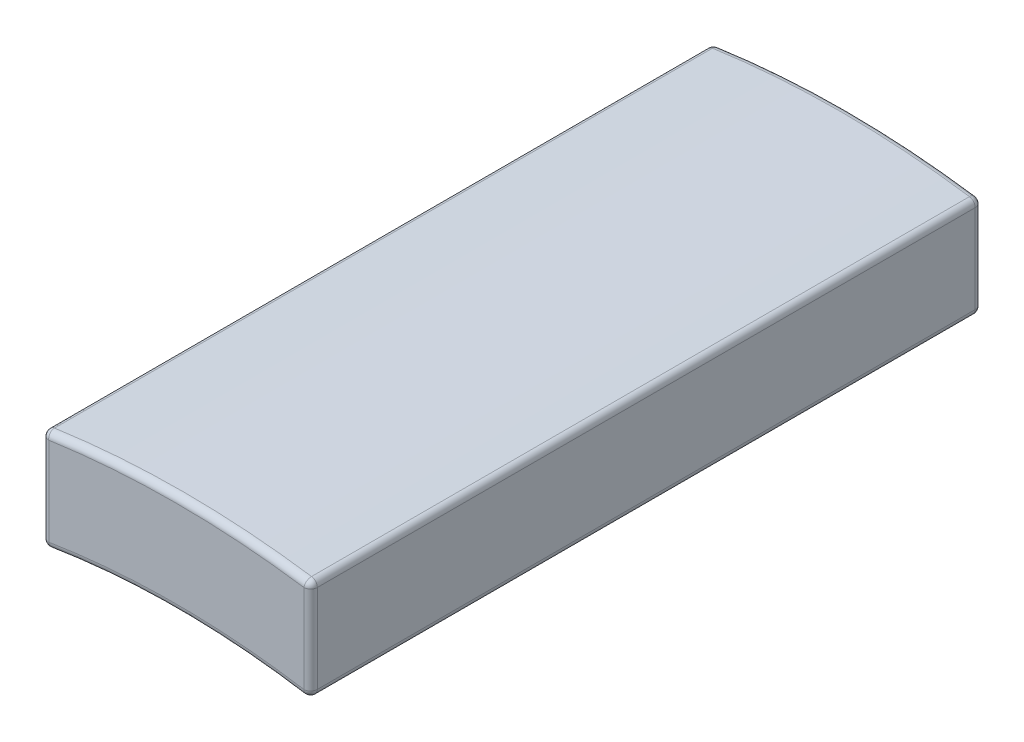
ISO-10303-21;
HEADER;
FILE_DESCRIPTION(('STEP AP214'),'2;1');
FILE_NAME('part.step','',(''),(''),'','','');
FILE_SCHEMA(('AUTOMOTIVE_DESIGN { 1 0 10303 214 1 1 1 1 }'));
ENDSEC;
DATA;
#1=APPLICATION_CONTEXT('core data for automotive mechanical design processes');
#2=APPLICATION_PROTOCOL_DEFINITION('international standard','automotive_design',2000,#1);
#3=PRODUCT_CONTEXT('',#1,'mechanical');
#4=PRODUCT('Part','Part','',(#3));
#5=PRODUCT_RELATED_PRODUCT_CATEGORY('part','',(#4));
#6=PRODUCT_DEFINITION_FORMATION('','',#4);
#7=PRODUCT_DEFINITION_CONTEXT('part definition',#1,'design');
#8=PRODUCT_DEFINITION('design','',#6,#7);
#9=PRODUCT_DEFINITION_SHAPE('','',#8);
#10=(LENGTH_UNIT() NAMED_UNIT(*) SI_UNIT(.MILLI.,.METRE.));
#11=(NAMED_UNIT(*) PLANE_ANGLE_UNIT() SI_UNIT($,.RADIAN.));
#12=(NAMED_UNIT(*) SI_UNIT($,.STERADIAN.) SOLID_ANGLE_UNIT());
#13=UNCERTAINTY_MEASURE_WITH_UNIT(LENGTH_MEASURE(1.E-05),#10,'distance_accuracy_value','');
#14=(GEOMETRIC_REPRESENTATION_CONTEXT(3) GLOBAL_UNCERTAINTY_ASSIGNED_CONTEXT((#13)) GLOBAL_UNIT_ASSIGNED_CONTEXT((#10,
#11,#12)) REPRESENTATION_CONTEXT('',''));
#15=CARTESIAN_POINT('',(0.,0.,0.));
#16=DIRECTION('',(0.,0.,1.));
#17=DIRECTION('',(1.,0.,0.));
#18=AXIS2_PLACEMENT_3D('',#15,#16,#17);
#19=CARTESIAN_POINT('',(0.,0.,0.1));
#20=DIRECTION('',(0.,0.,1.));
#21=DIRECTION('',(1.,0.,0.));
#22=AXIS2_PLACEMENT_3D('',#19,#20,#21);
#23=TOROIDAL_SURFACE('',#22,11.95,0.1);
#24=CARTESIAN_POINT('',(-1.9,11.7979871164534,0.1));
#25=DIRECTION('',(0.987279256606977,0.158995815899586,0.));
#26=DIRECTION('',(-0.158995815899586,0.987279256606977,0.));
#27=AXIS2_PLACEMENT_3D('',#24,#25,#26);
#28=CIRCLE('',#27,0.1);
#29=CARTESIAN_POINT('',(-1.88410041841004,11.6992591907927,0.1));
#30=VERTEX_POINT('',#29);
#31=CARTESIAN_POINT('',(-1.9,11.7979871164534,0.));
#32=VERTEX_POINT('',#31);
#33=EDGE_CURVE('E28',#30,#32,#28,.T.);
#34=ORIENTED_EDGE('',*,*,#33,.T.);
#35=CARTESIAN_POINT('',(0.,0.,0.));
#36=DIRECTION('',(0.,0.,1.));
#37=DIRECTION('',(1.,0.,0.));
#38=AXIS2_PLACEMENT_3D('',#35,#36,#37);
#39=CIRCLE('',#38,11.95);
#40=CARTESIAN_POINT('',(1.9,11.7979871164534,0.));
#41=VERTEX_POINT('',#40);
#42=EDGE_CURVE('E167',#41,#32,#39,.T.);
#43=ORIENTED_EDGE('',*,*,#42,.F.);
#44=CARTESIAN_POINT('',(1.9,11.7979871164534,0.1));
#45=DIRECTION('',(-0.987279256606978,0.158995815899582,0.));
#46=DIRECTION('',(-0.158995815899582,-0.987279256606978,0.));
#47=AXIS2_PLACEMENT_3D('',#44,#45,#46);
#48=CIRCLE('',#47,0.1);
#49=CARTESIAN_POINT('',(1.88410041841004,11.6992591907927,0.1));
#50=VERTEX_POINT('',#49);
#51=EDGE_CURVE('E11',#41,#50,#48,.T.);
#52=ORIENTED_EDGE('',*,*,#51,.T.);
#53=CARTESIAN_POINT('',(0.,0.,0.1));
#54=DIRECTION('',(0.,0.,-1.));
#55=DIRECTION('',(1.,0.,0.));
#56=AXIS2_PLACEMENT_3D('',#53,#54,#55);
#57=CIRCLE('',#56,11.85);
#58=EDGE_CURVE('E274',#30,#50,#57,.T.);
#59=ORIENTED_EDGE('',*,*,#58,.F.);
#60=EDGE_LOOP('',(#34,#43,#52,#59));
#61=FACE_BOUND('',#60,.T.);
#62=ADVANCED_FACE('F17',(#61),#23,.T.);
#63=CARTESIAN_POINT('',(1.9,11.7979871164534,0.1));
#64=DIRECTION('',(0.,1.,0.));
#65=DIRECTION('',(1.,0.,0.));
#66=AXIS2_PLACEMENT_3D('',#63,#64,#65);
#67=SPHERICAL_SURFACE('',#66,0.1);
#68=CARTESIAN_POINT('',(1.9,11.7979871164534,0.1));
#69=DIRECTION('',(0.,-1.,0.));
#70=DIRECTION('',(0.,0.,-1.));
#71=AXIS2_PLACEMENT_3D('',#68,#69,#70);
#72=CIRCLE('',#71,0.1);
#73=CARTESIAN_POINT('',(2.,11.7979871164534,0.1));
#74=VERTEX_POINT('',#73);
#75=EDGE_CURVE('E21',#41,#74,#72,.T.);
#76=ORIENTED_EDGE('',*,*,#75,.T.);
#77=CARTESIAN_POINT('',(1.9,11.7979871164534,0.1));
#78=DIRECTION('',(0.,0.,1.));
#79=DIRECTION('',(-1.,0.,0.));
#80=AXIS2_PLACEMENT_3D('',#77,#78,#79);
#81=CIRCLE('',#80,0.1);
#82=EDGE_CURVE('E151',#50,#74,#81,.T.);
#83=ORIENTED_EDGE('',*,*,#82,.F.);
#84=ORIENTED_EDGE('',*,*,#51,.F.);
#85=EDGE_LOOP('',(#76,#83,#84));
#86=FACE_BOUND('',#85,.T.);
#87=ADVANCED_FACE('F148',(#86),#67,.T.);
#88=CARTESIAN_POINT('',(-1.9,11.7979871164534,0.1));
#89=DIRECTION('',(0.,1.,0.));
#90=DIRECTION('',(1.,0.,0.));
#91=AXIS2_PLACEMENT_3D('',#88,#89,#90);
#92=SPHERICAL_SURFACE('',#91,0.1);
#93=CARTESIAN_POINT('',(-1.9,11.7979871164534,0.1));
#94=DIRECTION('',(0.,0.,1.));
#95=DIRECTION('',(-1.,0.,0.));
#96=AXIS2_PLACEMENT_3D('',#93,#94,#95);
#97=CIRCLE('',#96,0.1);
#98=CARTESIAN_POINT('',(-2.,11.7979871164534,0.1));
#99=VERTEX_POINT('',#98);
#100=EDGE_CURVE('E190',#99,#30,#97,.T.);
#101=ORIENTED_EDGE('',*,*,#100,.F.);
#102=CARTESIAN_POINT('',(-1.9,11.7979871164534,0.1));
#103=DIRECTION('',(0.,-1.,0.));
#104=DIRECTION('',(0.,0.,-1.));
#105=AXIS2_PLACEMENT_3D('',#102,#103,#104);
#106=CIRCLE('',#105,0.1);
#107=EDGE_CURVE('E165',#99,#32,#106,.T.);
#108=ORIENTED_EDGE('',*,*,#107,.T.);
#109=ORIENTED_EDGE('',*,*,#33,.F.);
#110=EDGE_LOOP('',(#101,#108,#109));
#111=FACE_BOUND('',#110,.T.);
#112=ADVANCED_FACE('F584',(#111),#92,.T.);
#113=CARTESIAN_POINT('',(1.9,11.7979871164534,0.1));
#114=DIRECTION('',(0.,1.,0.));
#115=DIRECTION('',(0.,0.,1.));
#116=AXIS2_PLACEMENT_3D('',#113,#114,#115);
#117=CYLINDRICAL_SURFACE('',#116,0.1);
#118=CARTESIAN_POINT('',(1.9,13.1130660030368,0.1));
#119=DIRECTION('',(0.,-1.,0.));
#120=DIRECTION('',(0.,0.,-1.));
#121=AXIS2_PLACEMENT_3D('',#118,#119,#120);
#122=CIRCLE('',#121,0.1);
#123=CARTESIAN_POINT('',(1.9,13.1130660030368,0.));
#124=VERTEX_POINT('',#123);
#125=CARTESIAN_POINT('',(2.,13.1130660030368,0.1));
#126=VERTEX_POINT('',#125);
#127=EDGE_CURVE('E210',#124,#126,#122,.T.);
#128=ORIENTED_EDGE('',*,*,#127,.T.);
#129=DIRECTION('',(0.,1.,0.));
#130=VECTOR('',#129,1.);
#131=CARTESIAN_POINT('',(2.,11.7979871164534,0.1));
#132=LINE('',#131,#130);
#133=EDGE_CURVE('E162',#74,#126,#132,.T.);
#134=ORIENTED_EDGE('',*,*,#133,.F.);
#135=ORIENTED_EDGE('',*,*,#75,.F.);
#136=DIRECTION('',(0.,-1.,0.));
#137=VECTOR('',#136,1.);
#138=CARTESIAN_POINT('',(1.9,11.7979871164534,0.));
#139=LINE('',#138,#137);
#140=EDGE_CURVE('E160',#124,#41,#139,.T.);
#141=ORIENTED_EDGE('',*,*,#140,.F.);
#142=EDGE_LOOP('',(#128,#134,#135,#141));
#143=FACE_BOUND('',#142,.T.);
#144=ADVANCED_FACE('F158',(#143),#117,.T.);
#145=CARTESIAN_POINT('',(-1.9,11.7979871164534,0.1));
#146=DIRECTION('',(0.,-1.,0.));
#147=DIRECTION('',(0.,0.,-1.));
#148=AXIS2_PLACEMENT_3D('',#145,#146,#147);
#149=CYLINDRICAL_SURFACE('',#148,0.1);
#150=CARTESIAN_POINT('',(-1.9,13.1130660030368,0.1));
#151=DIRECTION('',(0.,-1.,0.));
#152=DIRECTION('',(0.,0.,-1.));
#153=AXIS2_PLACEMENT_3D('',#150,#151,#152);
#154=CIRCLE('',#153,0.1);
#155=CARTESIAN_POINT('',(-2.,13.1130660030368,0.1));
#156=VERTEX_POINT('',#155);
#157=CARTESIAN_POINT('',(-1.9,13.1130660030368,0.));
#158=VERTEX_POINT('',#157);
#159=EDGE_CURVE('E43',#156,#158,#154,.T.);
#160=ORIENTED_EDGE('',*,*,#159,.T.);
#161=DIRECTION('',(0.,1.,0.));
#162=VECTOR('',#161,1.);
#163=CARTESIAN_POINT('',(-1.9,11.7979871164534,0.));
#164=LINE('',#163,#162);
#165=EDGE_CURVE('E172',#32,#158,#164,.T.);
#166=ORIENTED_EDGE('',*,*,#165,.F.);
#167=ORIENTED_EDGE('',*,*,#107,.F.);
#168=DIRECTION('',(0.,-1.,0.));
#169=VECTOR('',#168,1.);
#170=CARTESIAN_POINT('',(-2.,11.7979871164534,0.1));
#171=LINE('',#170,#169);
#172=EDGE_CURVE('E253',#156,#99,#171,.T.);
#173=ORIENTED_EDGE('',*,*,#172,.F.);
#174=EDGE_LOOP('',(#160,#166,#167,#173));
#175=FACE_BOUND('',#174,.T.);
#176=ADVANCED_FACE('F298',(#175),#149,.T.);
#177=CARTESIAN_POINT('',(1.9,13.1130660030368,0.1));
#178=DIRECTION('',(0.,1.,0.));
#179=DIRECTION('',(1.,0.,0.));
#180=AXIS2_PLACEMENT_3D('',#177,#178,#179);
#181=SPHERICAL_SURFACE('',#180,0.1);
#182=CARTESIAN_POINT('',(1.9,13.1130660030368,0.1));
#183=DIRECTION('',(0.98966535871976,-0.14339622641509,0.));
#184=DIRECTION('',(0.14339622641509,0.98966535871976,0.));
#185=AXIS2_PLACEMENT_3D('',#182,#183,#184);
#186=CIRCLE('',#185,0.1);
#187=CARTESIAN_POINT('',(1.91433962264151,13.2120325389088,0.1));
#188=VERTEX_POINT('',#187);
#189=EDGE_CURVE('E128',#124,#188,#186,.T.);
#190=ORIENTED_EDGE('',*,*,#189,.T.);
#191=CARTESIAN_POINT('',(1.9,13.1130660030368,0.1));
#192=DIRECTION('',(0.,0.,1.));
#193=DIRECTION('',(-1.,0.,0.));
#194=AXIS2_PLACEMENT_3D('',#191,#192,#193);
#195=CIRCLE('',#194,0.1);
#196=EDGE_CURVE('E309',#126,#188,#195,.T.);
#197=ORIENTED_EDGE('',*,*,#196,.F.);
#198=ORIENTED_EDGE('',*,*,#127,.F.);
#199=EDGE_LOOP('',(#190,#197,#198));
#200=FACE_BOUND('',#199,.T.);
#201=ADVANCED_FACE('F690',(#200),#181,.T.);
#202=CARTESIAN_POINT('',(-1.9,13.1130660030368,0.1));
#203=DIRECTION('',(0.,1.,0.));
#204=DIRECTION('',(1.,0.,0.));
#205=AXIS2_PLACEMENT_3D('',#202,#203,#204);
#206=SPHERICAL_SURFACE('',#205,0.1);
#207=CARTESIAN_POINT('',(-1.9,13.1130660030368,0.1));
#208=DIRECTION('',(0.,0.,1.));
#209=DIRECTION('',(-1.,0.,0.));
#210=AXIS2_PLACEMENT_3D('',#207,#208,#209);
#211=CIRCLE('',#210,0.1);
#212=CARTESIAN_POINT('',(-1.91433962264151,13.2120325389088,0.1));
#213=VERTEX_POINT('',#212);
#214=EDGE_CURVE('E242',#213,#156,#211,.T.);
#215=ORIENTED_EDGE('',*,*,#214,.F.);
#216=CARTESIAN_POINT('',(-1.9,13.1130660030368,0.1));
#217=DIRECTION('',(-0.98966535871976,-0.143396226415095,0.));
#218=DIRECTION('',(0.143396226415095,-0.98966535871976,0.));
#219=AXIS2_PLACEMENT_3D('',#216,#217,#218);
#220=CIRCLE('',#219,0.1);
#221=EDGE_CURVE('E204',#213,#158,#220,.T.);
#222=ORIENTED_EDGE('',*,*,#221,.T.);
#223=ORIENTED_EDGE('',*,*,#159,.F.);
#224=EDGE_LOOP('',(#215,#222,#223));
#225=FACE_BOUND('',#224,.T.);
#226=ADVANCED_FACE('F295',(#225),#206,.T.);
#227=CARTESIAN_POINT('',(0.,0.,0.1));
#228=DIRECTION('',(0.,0.,1.));
#229=DIRECTION('',(1.,0.,0.));
#230=AXIS2_PLACEMENT_3D('',#227,#228,#229);
#231=TOROIDAL_SURFACE('',#230,13.25,0.1);
#232=ORIENTED_EDGE('',*,*,#221,.F.);
#233=CARTESIAN_POINT('',(0.,0.,0.1));
#234=DIRECTION('',(0.,0.,1.));
#235=DIRECTION('',(1.,0.,0.));
#236=AXIS2_PLACEMENT_3D('',#233,#234,#235);
#237=CIRCLE('',#236,13.35);
#238=EDGE_CURVE('E211',#188,#213,#237,.T.);
#239=ORIENTED_EDGE('',*,*,#238,.F.);
#240=ORIENTED_EDGE('',*,*,#189,.F.);
#241=CARTESIAN_POINT('',(0.,0.,0.));
#242=DIRECTION('',(0.,0.,-1.));
#243=DIRECTION('',(1.,0.,0.));
#244=AXIS2_PLACEMENT_3D('',#241,#242,#243);
#245=CIRCLE('',#244,13.25);
#246=EDGE_CURVE('E177',#158,#124,#245,.T.);
#247=ORIENTED_EDGE('',*,*,#246,.F.);
#248=EDGE_LOOP('',(#232,#239,#240,#247));
#249=FACE_BOUND('',#248,.T.);
#250=ADVANCED_FACE('F293',(#249),#231,.T.);
#251=CARTESIAN_POINT('',(-1.9,11.7979871164534,9.9));
#252=DIRECTION('',(0.,1.,0.));
#253=DIRECTION('',(0.,0.,1.));
#254=AXIS2_PLACEMENT_3D('',#251,#252,#253);
#255=CYLINDRICAL_SURFACE('',#254,0.1);
#256=CARTESIAN_POINT('',(-1.9,13.1130660030368,9.9));
#257=DIRECTION('',(0.,-1.,0.));
#258=DIRECTION('',(0.,0.,-1.));
#259=AXIS2_PLACEMENT_3D('',#256,#257,#258);
#260=CIRCLE('',#259,0.1);
#261=CARTESIAN_POINT('',(-1.9,13.1130660030368,10.));
#262=VERTEX_POINT('',#261);
#263=CARTESIAN_POINT('',(-2.,13.1130660030368,9.9));
#264=VERTEX_POINT('',#263);
#265=EDGE_CURVE('E225',#262,#264,#260,.T.);
#266=ORIENTED_EDGE('',*,*,#265,.T.);
#267=DIRECTION('',(0.,1.,0.));
#268=VECTOR('',#267,1.);
#269=CARTESIAN_POINT('',(-2.,13.1130660030368,9.9));
#270=LINE('',#269,#268);
#271=CARTESIAN_POINT('',(-2.,11.7979871164534,9.9));
#272=VERTEX_POINT('',#271);
#273=EDGE_CURVE('E279',#272,#264,#270,.T.);
#274=ORIENTED_EDGE('',*,*,#273,.F.);
#275=CARTESIAN_POINT('',(-1.9,11.7979871164534,9.9));
#276=DIRECTION('',(0.,1.,0.));
#277=DIRECTION('',(0.,0.,1.));
#278=AXIS2_PLACEMENT_3D('',#275,#276,#277);
#279=CIRCLE('',#278,0.1);
#280=CARTESIAN_POINT('',(-1.9,11.7979871164534,10.));
#281=VERTEX_POINT('',#280);
#282=EDGE_CURVE('E207',#272,#281,#279,.T.);
#283=ORIENTED_EDGE('',*,*,#282,.T.);
#284=DIRECTION('',(0.,-1.,0.));
#285=VECTOR('',#284,1.);
#286=CARTESIAN_POINT('',(-1.9,11.7979871164534,10.));
#287=LINE('',#286,#285);
#288=EDGE_CURVE('E195',#262,#281,#287,.T.);
#289=ORIENTED_EDGE('',*,*,#288,.F.);
#290=EDGE_LOOP('',(#266,#274,#283,#289));
#291=FACE_BOUND('',#290,.T.);
#292=ADVANCED_FACE('F642',(#291),#255,.T.);
#293=CARTESIAN_POINT('',(-1.9,11.7979871164534,9.9));
#294=DIRECTION('',(0.,1.,0.));
#295=DIRECTION('',(1.,0.,0.));
#296=AXIS2_PLACEMENT_3D('',#293,#294,#295);
#297=SPHERICAL_SURFACE('',#296,0.1);
#298=CARTESIAN_POINT('',(-1.9,11.7979871164534,9.9));
#299=DIRECTION('',(0.,0.,-1.));
#300=DIRECTION('',(-1.,0.,0.));
#301=AXIS2_PLACEMENT_3D('',#298,#299,#300);
#302=CIRCLE('',#301,0.1);
#303=CARTESIAN_POINT('',(-1.88410041841004,11.6992591907927,9.9));
#304=VERTEX_POINT('',#303);
#305=EDGE_CURVE('E235',#304,#272,#302,.T.);
#306=ORIENTED_EDGE('',*,*,#305,.F.);
#307=CARTESIAN_POINT('',(-1.9,11.7979871164534,9.9));
#308=DIRECTION('',(-0.987279256606977,-0.158995815899584,0.));
#309=DIRECTION('',(0.158995815899584,-0.987279256606977,0.));
#310=AXIS2_PLACEMENT_3D('',#307,#308,#309);
#311=CIRCLE('',#310,0.1);
#312=EDGE_CURVE('E221',#304,#281,#311,.T.);
#313=ORIENTED_EDGE('',*,*,#312,.T.);
#314=ORIENTED_EDGE('',*,*,#282,.F.);
#315=EDGE_LOOP('',(#306,#313,#314));
#316=FACE_BOUND('',#315,.T.);
#317=ADVANCED_FACE('F638',(#316),#297,.T.);
#318=CARTESIAN_POINT('',(-1.9,13.1130660030368,9.9));
#319=DIRECTION('',(0.,1.,0.));
#320=DIRECTION('',(1.,0.,0.));
#321=AXIS2_PLACEMENT_3D('',#318,#319,#320);
#322=SPHERICAL_SURFACE('',#321,0.1);
#323=CARTESIAN_POINT('',(-1.9,13.1130660030368,9.9));
#324=DIRECTION('',(-0.989665358719761,-0.143396226415086,0.));
#325=DIRECTION('',(0.143396226415086,-0.989665358719761,0.));
#326=AXIS2_PLACEMENT_3D('',#323,#324,#325);
#327=CIRCLE('',#326,0.1);
#328=CARTESIAN_POINT('',(-1.91433962264151,13.2120325389088,9.9));
#329=VERTEX_POINT('',#328);
#330=EDGE_CURVE('E226',#262,#329,#327,.T.);
#331=ORIENTED_EDGE('',*,*,#330,.T.);
#332=CARTESIAN_POINT('',(-1.9,13.1130660030368,9.9));
#333=DIRECTION('',(0.,0.,-1.));
#334=DIRECTION('',(-1.,0.,0.));
#335=AXIS2_PLACEMENT_3D('',#332,#333,#334);
#336=CIRCLE('',#335,0.1);
#337=EDGE_CURVE('E241',#264,#329,#336,.T.);
#338=ORIENTED_EDGE('',*,*,#337,.F.);
#339=ORIENTED_EDGE('',*,*,#265,.F.);
#340=EDGE_LOOP('',(#331,#338,#339));
#341=FACE_BOUND('',#340,.T.);
#342=ADVANCED_FACE('F593',(#341),#322,.T.);
#343=CARTESIAN_POINT('',(0.,0.,9.9));
#344=DIRECTION('',(0.,0.,1.));
#345=DIRECTION('',(1.,0.,0.));
#346=AXIS2_PLACEMENT_3D('',#343,#344,#345);
#347=TOROIDAL_SURFACE('',#346,11.95,0.1);
#348=CARTESIAN_POINT('',(1.9,11.7979871164534,9.9));
#349=DIRECTION('',(-0.987279256606978,0.158995815899582,0.));
#350=DIRECTION('',(-0.158995815899582,-0.987279256606978,0.));
#351=AXIS2_PLACEMENT_3D('',#348,#349,#350);
#352=CIRCLE('',#351,0.1);
#353=CARTESIAN_POINT('',(1.88410041841004,11.6992591907927,9.9));
#354=VERTEX_POINT('',#353);
#355=CARTESIAN_POINT('',(1.9,11.7979871164534,10.));
#356=VERTEX_POINT('',#355);
#357=EDGE_CURVE('E202',#354,#356,#352,.T.);
#358=ORIENTED_EDGE('',*,*,#357,.T.);
#359=CARTESIAN_POINT('',(0.,0.,10.));
#360=DIRECTION('',(0.,0.,-1.));
#361=DIRECTION('',(1.,0.,0.));
#362=AXIS2_PLACEMENT_3D('',#359,#360,#361);
#363=CIRCLE('',#362,11.95);
#364=EDGE_CURVE('E186',#281,#356,#363,.T.);
#365=ORIENTED_EDGE('',*,*,#364,.F.);
#366=ORIENTED_EDGE('',*,*,#312,.F.);
#367=CARTESIAN_POINT('',(0.,0.,9.9));
#368=DIRECTION('',(0.,0.,1.));
#369=DIRECTION('',(1.,0.,0.));
#370=AXIS2_PLACEMENT_3D('',#367,#368,#369);
#371=CIRCLE('',#370,11.85);
#372=EDGE_CURVE('E314',#354,#304,#371,.T.);
#373=ORIENTED_EDGE('',*,*,#372,.F.);
#374=EDGE_LOOP('',(#358,#365,#366,#373));
#375=FACE_BOUND('',#374,.T.);
#376=ADVANCED_FACE('F589',(#375),#347,.T.);
#377=CARTESIAN_POINT('',(0.,0.,9.9));
#378=DIRECTION('',(0.,0.,1.));
#379=DIRECTION('',(1.,0.,0.));
#380=AXIS2_PLACEMENT_3D('',#377,#378,#379);
#381=TOROIDAL_SURFACE('',#380,13.25,0.1);
#382=CARTESIAN_POINT('',(1.9,13.1130660030368,9.9));
#383=DIRECTION('',(-0.98966535871976,0.14339622641509,0.));
#384=DIRECTION('',(-0.14339622641509,-0.98966535871976,0.));
#385=AXIS2_PLACEMENT_3D('',#382,#383,#384);
#386=CIRCLE('',#385,0.1);
#387=CARTESIAN_POINT('',(1.9,13.1130660030368,10.));
#388=VERTEX_POINT('',#387);
#389=CARTESIAN_POINT('',(1.91433962264151,13.2120325389088,9.9));
#390=VERTEX_POINT('',#389);
#391=EDGE_CURVE('E112',#388,#390,#386,.T.);
#392=ORIENTED_EDGE('',*,*,#391,.T.);
#393=CARTESIAN_POINT('',(0.,0.,9.9));
#394=DIRECTION('',(0.,0.,-1.));
#395=DIRECTION('',(1.,0.,0.));
#396=AXIS2_PLACEMENT_3D('',#393,#394,#395);
#397=CIRCLE('',#396,13.35);
#398=EDGE_CURVE('E255',#329,#390,#397,.T.);
#399=ORIENTED_EDGE('',*,*,#398,.F.);
#400=ORIENTED_EDGE('',*,*,#330,.F.);
#401=CARTESIAN_POINT('',(0.,0.,10.));
#402=DIRECTION('',(0.,0.,1.));
#403=DIRECTION('',(1.,0.,0.));
#404=AXIS2_PLACEMENT_3D('',#401,#402,#403);
#405=CIRCLE('',#404,13.25);
#406=EDGE_CURVE('E199',#388,#262,#405,.T.);
#407=ORIENTED_EDGE('',*,*,#406,.F.);
#408=EDGE_LOOP('',(#392,#399,#400,#407));
#409=FACE_BOUND('',#408,.T.);
#410=ADVANCED_FACE('F19',(#409),#381,.T.);
#411=CARTESIAN_POINT('',(1.9,11.7979871164534,9.9));
#412=DIRECTION('',(0.,1.,0.));
#413=DIRECTION('',(1.,0.,0.));
#414=AXIS2_PLACEMENT_3D('',#411,#412,#413);
#415=SPHERICAL_SURFACE('',#414,0.1);
#416=CARTESIAN_POINT('',(1.9,11.7979871164534,9.9));
#417=DIRECTION('',(0.,0.,-1.));
#418=DIRECTION('',(-1.,0.,0.));
#419=AXIS2_PLACEMENT_3D('',#416,#417,#418);
#420=CIRCLE('',#419,0.1);
#421=CARTESIAN_POINT('',(2.,11.7979871164534,9.9));
#422=VERTEX_POINT('',#421);
#423=EDGE_CURVE('E220',#422,#354,#420,.T.);
#424=ORIENTED_EDGE('',*,*,#423,.F.);
#425=CARTESIAN_POINT('',(1.9,11.7979871164534,9.9));
#426=DIRECTION('',(0.,-1.,0.));
#427=DIRECTION('',(0.,0.,-1.));
#428=AXIS2_PLACEMENT_3D('',#425,#426,#427);
#429=CIRCLE('',#428,0.1);
#430=EDGE_CURVE('E194',#422,#356,#429,.T.);
#431=ORIENTED_EDGE('',*,*,#430,.T.);
#432=ORIENTED_EDGE('',*,*,#357,.F.);
#433=EDGE_LOOP('',(#424,#431,#432));
#434=FACE_BOUND('',#433,.T.);
#435=ADVANCED_FACE('F714',(#434),#415,.T.);
#436=CARTESIAN_POINT('',(1.9,13.1130660030368,9.9));
#437=DIRECTION('',(0.,1.,0.));
#438=DIRECTION('',(1.,0.,0.));
#439=AXIS2_PLACEMENT_3D('',#436,#437,#438);
#440=SPHERICAL_SURFACE('',#439,0.1);
#441=CARTESIAN_POINT('',(1.9,13.1130660030368,9.9));
#442=DIRECTION('',(0.,1.,0.));
#443=DIRECTION('',(0.,0.,1.));
#444=AXIS2_PLACEMENT_3D('',#441,#442,#443);
#445=CIRCLE('',#444,0.1);
#446=CARTESIAN_POINT('',(2.,13.1130660030368,9.9));
#447=VERTEX_POINT('',#446);
#448=EDGE_CURVE('E203',#388,#447,#445,.T.);
#449=ORIENTED_EDGE('',*,*,#448,.T.);
#450=CARTESIAN_POINT('',(1.9,13.1130660030368,9.9));
#451=DIRECTION('',(0.,0.,-1.));
#452=DIRECTION('',(-1.,0.,0.));
#453=AXIS2_PLACEMENT_3D('',#450,#451,#452);
#454=CIRCLE('',#453,0.1);
#455=EDGE_CURVE('E216',#390,#447,#454,.T.);
#456=ORIENTED_EDGE('',*,*,#455,.F.);
#457=ORIENTED_EDGE('',*,*,#391,.F.);
#458=EDGE_LOOP('',(#449,#456,#457));
#459=FACE_BOUND('',#458,.T.);
#460=ADVANCED_FACE('F710',(#459),#440,.T.);
#461=CARTESIAN_POINT('',(1.9,11.7979871164534,9.9));
#462=DIRECTION('',(0.,-1.,0.));
#463=DIRECTION('',(0.,0.,-1.));
#464=AXIS2_PLACEMENT_3D('',#461,#462,#463);
#465=CYLINDRICAL_SURFACE('',#464,0.1);
#466=ORIENTED_EDGE('',*,*,#430,.F.);
#467=DIRECTION('',(0.,-1.,0.));
#468=VECTOR('',#467,1.);
#469=CARTESIAN_POINT('',(2.,11.7979871164534,9.9));
#470=LINE('',#469,#468);
#471=EDGE_CURVE('E270',#447,#422,#470,.T.);
#472=ORIENTED_EDGE('',*,*,#471,.F.);
#473=ORIENTED_EDGE('',*,*,#448,.F.);
#474=DIRECTION('',(0.,1.,0.));
#475=VECTOR('',#474,1.);
#476=CARTESIAN_POINT('',(1.9,13.1130660030368,10.));
#477=LINE('',#476,#475);
#478=EDGE_CURVE('E179',#356,#388,#477,.T.);
#479=ORIENTED_EDGE('',*,*,#478,.F.);
#480=EDGE_LOOP('',(#466,#472,#473,#479));
#481=FACE_BOUND('',#480,.T.);
#482=ADVANCED_FACE('F682',(#481),#465,.T.);
#483=CARTESIAN_POINT('',(-1.9,11.7979871164534,0.));
#484=DIRECTION('',(0.,0.,1.));
#485=DIRECTION('',(1.,0.,0.));
#486=AXIS2_PLACEMENT_3D('',#483,#484,#485);
#487=PLANE('',#486);
#488=ORIENTED_EDGE('',*,*,#140,.T.);
#489=ORIENTED_EDGE('',*,*,#42,.T.);
#490=ORIENTED_EDGE('',*,*,#165,.T.);
#491=ORIENTED_EDGE('',*,*,#246,.T.);
#492=EDGE_LOOP('',(#488,#489,#490,#491));
#493=FACE_BOUND('',#492,.T.);
#494=ADVANCED_FACE('F175',(#493),#487,.F.);
#495=CARTESIAN_POINT('',(-1.9,11.7979871164534,10.));
#496=DIRECTION('',(0.,0.,1.));
#497=DIRECTION('',(1.,0.,0.));
#498=AXIS2_PLACEMENT_3D('',#495,#496,#497);
#499=PLANE('',#498);
#500=ORIENTED_EDGE('',*,*,#406,.T.);
#501=ORIENTED_EDGE('',*,*,#288,.T.);
#502=ORIENTED_EDGE('',*,*,#364,.T.);
#503=ORIENTED_EDGE('',*,*,#478,.T.);
#504=EDGE_LOOP('',(#500,#501,#502,#503));
#505=FACE_BOUND('',#504,.T.);
#506=ADVANCED_FACE('F666',(#505),#499,.T.);
#507=CARTESIAN_POINT('',(-2.,11.7979871164534,10.));
#508=DIRECTION('',(1.,0.,0.));
#509=DIRECTION('',(0.,1.,0.));
#510=AXIS2_PLACEMENT_3D('',#507,#508,#509);
#511=PLANE('',#510);
#512=DIRECTION('',(0.,0.,-1.));
#513=VECTOR('',#512,1.);
#514=CARTESIAN_POINT('',(-2.,13.1130660030368,10.));
#515=LINE('',#514,#513);
#516=EDGE_CURVE('E238',#264,#156,#515,.T.);
#517=ORIENTED_EDGE('',*,*,#516,.T.);
#518=ORIENTED_EDGE('',*,*,#172,.T.);
#519=DIRECTION('',(0.,0.,-1.));
#520=VECTOR('',#519,1.);
#521=CARTESIAN_POINT('',(-2.,11.7979871164534,10.));
#522=LINE('',#521,#520);
#523=EDGE_CURVE('E320',#272,#99,#522,.T.);
#524=ORIENTED_EDGE('',*,*,#523,.F.);
#525=ORIENTED_EDGE('',*,*,#273,.T.);
#526=EDGE_LOOP('',(#517,#518,#524,#525));
#527=FACE_BOUND('',#526,.T.);
#528=ADVANCED_FACE('F633',(#527),#511,.F.);
#529=CARTESIAN_POINT('',(-1.9,13.1130660030368,10.));
#530=DIRECTION('',(0.,0.,-1.));
#531=DIRECTION('',(-1.,0.,0.));
#532=AXIS2_PLACEMENT_3D('',#529,#530,#531);
#533=CYLINDRICAL_SURFACE('',#532,0.1);
#534=DIRECTION('',(0.,0.,-1.));
#535=VECTOR('',#534,1.);
#536=CARTESIAN_POINT('',(-1.91433962264151,13.2120325389088,10.));
#537=LINE('',#536,#535);
#538=EDGE_CURVE('E215',#329,#213,#537,.T.);
#539=ORIENTED_EDGE('',*,*,#538,.T.);
#540=ORIENTED_EDGE('',*,*,#214,.T.);
#541=ORIENTED_EDGE('',*,*,#516,.F.);
#542=ORIENTED_EDGE('',*,*,#337,.T.);
#543=EDGE_LOOP('',(#539,#540,#541,#542));
#544=FACE_BOUND('',#543,.T.);
#545=ADVANCED_FACE('F284',(#544),#533,.T.);
#546=CARTESIAN_POINT('',(0.,0.,10.));
#547=DIRECTION('',(0.,0.,-1.));
#548=DIRECTION('',(-1.,0.,0.));
#549=AXIS2_PLACEMENT_3D('',#546,#547,#548);
#550=CYLINDRICAL_SURFACE('',#549,13.35);
#551=DIRECTION('',(0.,0.,-1.));
#552=VECTOR('',#551,1.);
#553=CARTESIAN_POINT('',(1.91433962264151,13.2120325389088,10.));
#554=LINE('',#553,#552);
#555=EDGE_CURVE('E290',#390,#188,#554,.T.);
#556=ORIENTED_EDGE('',*,*,#555,.T.);
#557=ORIENTED_EDGE('',*,*,#238,.T.);
#558=ORIENTED_EDGE('',*,*,#538,.F.);
#559=ORIENTED_EDGE('',*,*,#398,.T.);
#560=EDGE_LOOP('',(#556,#557,#558,#559));
#561=FACE_BOUND('',#560,.T.);
#562=ADVANCED_FACE('F288',(#561),#550,.T.);
#563=CARTESIAN_POINT('',(1.9,13.1130660030368,10.));
#564=DIRECTION('',(0.,0.,-1.));
#565=DIRECTION('',(-1.,0.,0.));
#566=AXIS2_PLACEMENT_3D('',#563,#564,#565);
#567=CYLINDRICAL_SURFACE('',#566,0.1);
#568=DIRECTION('',(0.,0.,-1.));
#569=VECTOR('',#568,1.);
#570=CARTESIAN_POINT('',(2.,13.1130660030368,10.));
#571=LINE('',#570,#569);
#572=EDGE_CURVE('E219',#447,#126,#571,.T.);
#573=ORIENTED_EDGE('',*,*,#572,.T.);
#574=ORIENTED_EDGE('',*,*,#196,.T.);
#575=ORIENTED_EDGE('',*,*,#555,.F.);
#576=ORIENTED_EDGE('',*,*,#455,.T.);
#577=EDGE_LOOP('',(#573,#574,#575,#576));
#578=FACE_BOUND('',#577,.T.);
#579=ADVANCED_FACE('F616',(#578),#567,.T.);
#580=CARTESIAN_POINT('',(2.,11.7979871164534,10.));
#581=DIRECTION('',(-1.,0.,0.));
#582=DIRECTION('',(0.,0.,1.));
#583=AXIS2_PLACEMENT_3D('',#580,#581,#582);
#584=PLANE('',#583);
#585=DIRECTION('',(0.,0.,-1.));
#586=VECTOR('',#585,1.);
#587=CARTESIAN_POINT('',(2.,11.7979871164534,10.));
#588=LINE('',#587,#586);
#589=EDGE_CURVE('E236',#422,#74,#588,.T.);
#590=ORIENTED_EDGE('',*,*,#589,.T.);
#591=ORIENTED_EDGE('',*,*,#133,.T.);
#592=ORIENTED_EDGE('',*,*,#572,.F.);
#593=ORIENTED_EDGE('',*,*,#471,.T.);
#594=EDGE_LOOP('',(#590,#591,#592,#593));
#595=FACE_BOUND('',#594,.T.);
#596=ADVANCED_FACE('F624',(#595),#584,.F.);
#597=CARTESIAN_POINT('',(1.9,11.7979871164534,10.));
#598=DIRECTION('',(0.,0.,-1.));
#599=DIRECTION('',(-1.,0.,0.));
#600=AXIS2_PLACEMENT_3D('',#597,#598,#599);
#601=CYLINDRICAL_SURFACE('',#600,0.1);
#602=DIRECTION('',(0.,0.,-1.));
#603=VECTOR('',#602,1.);
#604=CARTESIAN_POINT('',(1.88410041841004,11.6992591907927,10.));
#605=LINE('',#604,#603);
#606=EDGE_CURVE('E311',#354,#50,#605,.T.);
#607=ORIENTED_EDGE('',*,*,#606,.T.);
#608=ORIENTED_EDGE('',*,*,#82,.T.);
#609=ORIENTED_EDGE('',*,*,#589,.F.);
#610=ORIENTED_EDGE('',*,*,#423,.T.);
#611=EDGE_LOOP('',(#607,#608,#609,#610));
#612=FACE_BOUND('',#611,.T.);
#613=ADVANCED_FACE('F576',(#612),#601,.T.);
#614=CARTESIAN_POINT('',(0.,0.,10.));
#615=DIRECTION('',(0.,0.,-1.));
#616=DIRECTION('',(-1.,0.,0.));
#617=AXIS2_PLACEMENT_3D('',#614,#615,#616);
#618=CYLINDRICAL_SURFACE('',#617,11.85);
#619=DIRECTION('',(0.,0.,-1.));
#620=VECTOR('',#619,1.);
#621=CARTESIAN_POINT('',(-1.88410041841004,11.6992591907927,10.));
#622=LINE('',#621,#620);
#623=EDGE_CURVE('E231',#304,#30,#622,.T.);
#624=ORIENTED_EDGE('',*,*,#623,.T.);
#625=ORIENTED_EDGE('',*,*,#58,.T.);
#626=ORIENTED_EDGE('',*,*,#606,.F.);
#627=ORIENTED_EDGE('',*,*,#372,.T.);
#628=EDGE_LOOP('',(#624,#625,#626,#627));
#629=FACE_BOUND('',#628,.T.);
#630=ADVANCED_FACE('F571',(#629),#618,.F.);
#631=CARTESIAN_POINT('',(-1.9,11.7979871164534,10.));
#632=DIRECTION('',(0.,0.,-1.));
#633=DIRECTION('',(-1.,0.,0.));
#634=AXIS2_PLACEMENT_3D('',#631,#632,#633);
#635=CYLINDRICAL_SURFACE('',#634,0.1);
#636=ORIENTED_EDGE('',*,*,#523,.T.);
#637=ORIENTED_EDGE('',*,*,#100,.T.);
#638=ORIENTED_EDGE('',*,*,#623,.F.);
#639=ORIENTED_EDGE('',*,*,#305,.T.);
#640=EDGE_LOOP('',(#636,#637,#638,#639));
#641=FACE_BOUND('',#640,.T.);
#642=ADVANCED_FACE('F575',(#641),#635,.T.);
#643=CLOSED_SHELL('',(#62,#87,#112,#144,#176,#201,#226,#250,#292,#317,#342,#376,#410,#435,#460,
#482,#494,#506,#528,#545,#562,#579,#596,#613,#630,#642));
#644=MANIFOLD_SOLID_BREP('B1',#643);
#645=ADVANCED_BREP_SHAPE_REPRESENTATION('',(#18,#644),#14);
#646=SHAPE_DEFINITION_REPRESENTATION(#9,#645);
ENDSEC;
END-ISO-10303-21;
